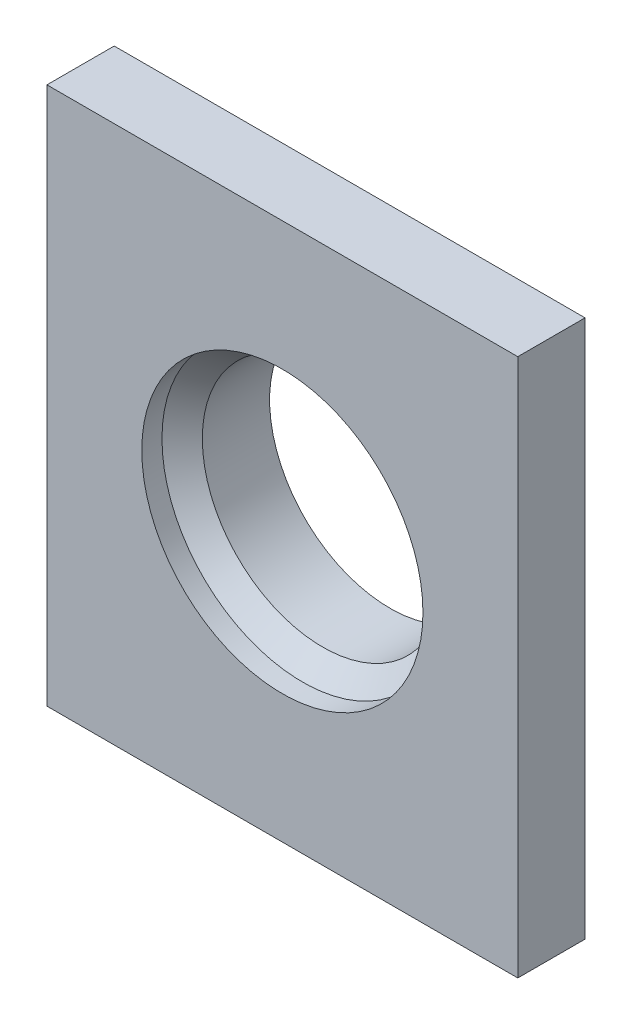
ISO-10303-21;
HEADER;
FILE_DESCRIPTION(('STEP AP214'),'2;1');
FILE_NAME('part.step','',(''),(''),'','','');
FILE_SCHEMA(('AUTOMOTIVE_DESIGN { 1 0 10303 214 1 1 1 1 }'));
ENDSEC;
DATA;
#1=APPLICATION_CONTEXT('core data for automotive mechanical design processes');
#2=APPLICATION_PROTOCOL_DEFINITION('international standard','automotive_design',2000,#1);
#3=PRODUCT_CONTEXT('',#1,'mechanical');
#4=PRODUCT('Part','Part','',(#3));
#5=PRODUCT_RELATED_PRODUCT_CATEGORY('part','',(#4));
#6=PRODUCT_DEFINITION_FORMATION('','',#4);
#7=PRODUCT_DEFINITION_CONTEXT('part definition',#1,'design');
#8=PRODUCT_DEFINITION('design','',#6,#7);
#9=PRODUCT_DEFINITION_SHAPE('','',#8);
#10=(LENGTH_UNIT() NAMED_UNIT(*) SI_UNIT(.MILLI.,.METRE.));
#11=(NAMED_UNIT(*) PLANE_ANGLE_UNIT() SI_UNIT($,.RADIAN.));
#12=(NAMED_UNIT(*) SI_UNIT($,.STERADIAN.) SOLID_ANGLE_UNIT());
#13=UNCERTAINTY_MEASURE_WITH_UNIT(LENGTH_MEASURE(1.E-05),#10,'distance_accuracy_value','');
#14=(GEOMETRIC_REPRESENTATION_CONTEXT(3) GLOBAL_UNCERTAINTY_ASSIGNED_CONTEXT((#13)) GLOBAL_UNIT_ASSIGNED_CONTEXT((#10,
#11,#12)) REPRESENTATION_CONTEXT('',''));
#15=CARTESIAN_POINT('',(0.,0.,0.));
#16=DIRECTION('',(0.,0.,1.));
#17=DIRECTION('',(1.,0.,0.));
#18=AXIS2_PLACEMENT_3D('',#15,#16,#17);
#19=CARTESIAN_POINT('',(17.5,20.,2.5));
#20=DIRECTION('',(-1.,0.,0.));
#21=DIRECTION('',(0.,0.,1.));
#22=AXIS2_PLACEMENT_3D('',#19,#20,#21);
#23=PLANE('',#22);
#24=DIRECTION('',(0.,1.,0.));
#25=VECTOR('',#24,1.);
#26=CARTESIAN_POINT('',(17.5,20.,-2.5));
#27=LINE('',#26,#25);
#28=CARTESIAN_POINT('',(17.5,-20.,-2.5));
#29=VERTEX_POINT('',#28);
#30=CARTESIAN_POINT('',(17.5,20.,-2.5));
#31=VERTEX_POINT('',#30);
#32=EDGE_CURVE('E112',#29,#31,#27,.T.);
#33=ORIENTED_EDGE('',*,*,#32,.T.);
#34=DIRECTION('',(0.,0.,-1.));
#35=VECTOR('',#34,1.);
#36=CARTESIAN_POINT('',(17.5,20.,2.5));
#37=LINE('',#36,#35);
#38=CARTESIAN_POINT('',(17.5,20.,2.5));
#39=VERTEX_POINT('',#38);
#40=EDGE_CURVE('E103',#39,#31,#37,.T.);
#41=ORIENTED_EDGE('',*,*,#40,.F.);
#42=DIRECTION('',(0.,1.,0.));
#43=VECTOR('',#42,1.);
#44=CARTESIAN_POINT('',(17.5,20.,2.5));
#45=LINE('',#44,#43);
#46=CARTESIAN_POINT('',(17.5,-20.,2.5));
#47=VERTEX_POINT('',#46);
#48=EDGE_CURVE('E97',#47,#39,#45,.T.);
#49=ORIENTED_EDGE('',*,*,#48,.F.);
#50=DIRECTION('',(0.,0.,-1.));
#51=VECTOR('',#50,1.);
#52=CARTESIAN_POINT('',(17.5,-20.,2.5));
#53=LINE('',#52,#51);
#54=EDGE_CURVE('E108',#47,#29,#53,.T.);
#55=ORIENTED_EDGE('',*,*,#54,.T.);
#56=EDGE_LOOP('',(#33,#41,#49,#55));
#57=FACE_BOUND('',#56,.T.);
#58=ADVANCED_FACE('F43',(#57),#23,.F.);
#59=CARTESIAN_POINT('',(-17.5,20.,2.5));
#60=DIRECTION('',(0.,-1.,0.));
#61=DIRECTION('',(0.,0.,-1.));
#62=AXIS2_PLACEMENT_3D('',#59,#60,#61);
#63=PLANE('',#62);
#64=DIRECTION('',(-1.,0.,0.));
#65=VECTOR('',#64,1.);
#66=CARTESIAN_POINT('',(-17.5,20.,-2.5));
#67=LINE('',#66,#65);
#68=CARTESIAN_POINT('',(-17.5,20.,-2.5));
#69=VERTEX_POINT('',#68);
#70=EDGE_CURVE('E102',#31,#69,#67,.T.);
#71=ORIENTED_EDGE('',*,*,#70,.T.);
#72=DIRECTION('',(0.,0.,-1.));
#73=VECTOR('',#72,1.);
#74=CARTESIAN_POINT('',(-17.5,20.,2.5));
#75=LINE('',#74,#73);
#76=CARTESIAN_POINT('',(-17.5,20.,2.5));
#77=VERTEX_POINT('',#76);
#78=EDGE_CURVE('E100',#77,#69,#75,.T.);
#79=ORIENTED_EDGE('',*,*,#78,.F.);
#80=DIRECTION('',(-1.,0.,0.));
#81=VECTOR('',#80,1.);
#82=CARTESIAN_POINT('',(-17.5,20.,2.5));
#83=LINE('',#82,#81);
#84=EDGE_CURVE('E92',#39,#77,#83,.T.);
#85=ORIENTED_EDGE('',*,*,#84,.F.);
#86=ORIENTED_EDGE('',*,*,#40,.T.);
#87=EDGE_LOOP('',(#71,#79,#85,#86));
#88=FACE_BOUND('',#87,.T.);
#89=ADVANCED_FACE('F101',(#88),#63,.F.);
#90=CARTESIAN_POINT('',(-17.5,20.,2.5));
#91=DIRECTION('',(1.,0.,0.));
#92=DIRECTION('',(0.,1.,0.));
#93=AXIS2_PLACEMENT_3D('',#90,#91,#92);
#94=PLANE('',#93);
#95=DIRECTION('',(0.,-1.,0.));
#96=VECTOR('',#95,1.);
#97=CARTESIAN_POINT('',(-17.5,20.,-2.5));
#98=LINE('',#97,#96);
#99=CARTESIAN_POINT('',(-17.5,-20.,-2.5));
#100=VERTEX_POINT('',#99);
#101=EDGE_CURVE('E78',#69,#100,#98,.T.);
#102=ORIENTED_EDGE('',*,*,#101,.T.);
#103=DIRECTION('',(0.,0.,-1.));
#104=VECTOR('',#103,1.);
#105=CARTESIAN_POINT('',(-17.5,-20.,2.5));
#106=LINE('',#105,#104);
#107=CARTESIAN_POINT('',(-17.5,-20.,2.5));
#108=VERTEX_POINT('',#107);
#109=EDGE_CURVE('E104',#108,#100,#106,.T.);
#110=ORIENTED_EDGE('',*,*,#109,.F.);
#111=DIRECTION('',(0.,-1.,0.));
#112=VECTOR('',#111,1.);
#113=CARTESIAN_POINT('',(-17.5,20.,2.5));
#114=LINE('',#113,#112);
#115=EDGE_CURVE('E95',#77,#108,#114,.T.);
#116=ORIENTED_EDGE('',*,*,#115,.F.);
#117=ORIENTED_EDGE('',*,*,#78,.T.);
#118=EDGE_LOOP('',(#102,#110,#116,#117));
#119=FACE_BOUND('',#118,.T.);
#120=ADVANCED_FACE('F106',(#119),#94,.F.);
#121=CARTESIAN_POINT('',(-17.5,-20.,2.5));
#122=DIRECTION('',(0.,1.,0.));
#123=DIRECTION('',(0.,0.,1.));
#124=AXIS2_PLACEMENT_3D('',#121,#122,#123);
#125=PLANE('',#124);
#126=DIRECTION('',(1.,0.,0.));
#127=VECTOR('',#126,1.);
#128=CARTESIAN_POINT('',(-17.5,-20.,-2.5));
#129=LINE('',#128,#127);
#130=EDGE_CURVE('E84',#100,#29,#129,.T.);
#131=ORIENTED_EDGE('',*,*,#130,.T.);
#132=ORIENTED_EDGE('',*,*,#54,.F.);
#133=DIRECTION('',(1.,0.,0.));
#134=VECTOR('',#133,1.);
#135=CARTESIAN_POINT('',(-17.5,-20.,2.5));
#136=LINE('',#135,#134);
#137=EDGE_CURVE('E61',#108,#47,#136,.T.);
#138=ORIENTED_EDGE('',*,*,#137,.F.);
#139=ORIENTED_EDGE('',*,*,#109,.T.);
#140=EDGE_LOOP('',(#131,#132,#138,#139));
#141=FACE_BOUND('',#140,.T.);
#142=ADVANCED_FACE('F159',(#141),#125,.F.);
#143=CARTESIAN_POINT('',(0.,0.,2.5));
#144=DIRECTION('',(0.,0.,1.));
#145=DIRECTION('',(1.,0.,0.));
#146=AXIS2_PLACEMENT_3D('',#143,#144,#145);
#147=PLANE('',#146);
#148=CARTESIAN_POINT('',(0.,0.,2.5));
#149=DIRECTION('',(0.,0.,1.));
#150=DIRECTION('',(1.,0.,0.));
#151=AXIS2_PLACEMENT_3D('',#148,#149,#150);
#152=CIRCLE('',#151,10.45);
#153=CARTESIAN_POINT('',(10.45,0.,2.5));
#154=VERTEX_POINT('',#153);
#155=EDGE_CURVE('E127',#154,#154,#152,.T.);
#156=ORIENTED_EDGE('',*,*,#155,.F.);
#157=EDGE_LOOP('',(#156));
#158=FACE_BOUND('',#157,.T.);
#159=ORIENTED_EDGE('',*,*,#48,.T.);
#160=ORIENTED_EDGE('',*,*,#84,.T.);
#161=ORIENTED_EDGE('',*,*,#115,.T.);
#162=ORIENTED_EDGE('',*,*,#137,.T.);
#163=EDGE_LOOP('',(#159,#160,#161,#162));
#164=FACE_BOUND('',#163,.T.);
#165=ADVANCED_FACE('F93',(#158,#164),#147,.T.);
#166=CARTESIAN_POINT('',(0.,0.,-2.5));
#167=DIRECTION('',(0.,0.,1.));
#168=DIRECTION('',(1.,0.,0.));
#169=AXIS2_PLACEMENT_3D('',#166,#167,#168);
#170=PLANE('',#169);
#171=CARTESIAN_POINT('',(0.,0.,-2.5));
#172=DIRECTION('',(0.,0.,1.));
#173=DIRECTION('',(1.,0.,0.));
#174=AXIS2_PLACEMENT_3D('',#171,#172,#173);
#175=CIRCLE('',#174,12.45);
#176=CARTESIAN_POINT('',(12.45,0.,-2.5));
#177=VERTEX_POINT('',#176);
#178=EDGE_CURVE('E12',#177,#177,#175,.T.);
#179=ORIENTED_EDGE('',*,*,#178,.T.);
#180=EDGE_LOOP('',(#179));
#181=FACE_BOUND('',#180,.T.);
#182=ORIENTED_EDGE('',*,*,#32,.F.);
#183=ORIENTED_EDGE('',*,*,#130,.F.);
#184=ORIENTED_EDGE('',*,*,#101,.F.);
#185=ORIENTED_EDGE('',*,*,#70,.F.);
#186=EDGE_LOOP('',(#182,#183,#184,#185));
#187=FACE_BOUND('',#186,.T.);
#188=ADVANCED_FACE('F162',(#181,#187),#170,.F.);
#189=CARTESIAN_POINT('',(0.,0.,-5.5));
#190=DIRECTION('',(0.,0.,1.));
#191=DIRECTION('',(1.,0.,0.));
#192=AXIS2_PLACEMENT_3D('',#189,#190,#191);
#193=CYLINDRICAL_SURFACE('',#192,10.95);
#194=CARTESIAN_POINT('',(0.,0.,-3.99999999999999));
#195=DIRECTION('',(0.,0.,1.));
#196=DIRECTION('',(1.,0.,0.));
#197=AXIS2_PLACEMENT_3D('',#194,#195,#196);
#198=CIRCLE('',#197,10.95);
#199=CARTESIAN_POINT('',(10.95,0.,-3.99999999999999));
#200=VERTEX_POINT('',#199);
#201=EDGE_CURVE('E53',#200,#200,#198,.F.);
#202=ORIENTED_EDGE('',*,*,#201,.T.);
#203=EDGE_LOOP('',(#202));
#204=FACE_BOUND('',#203,.T.);
#205=CARTESIAN_POINT('',(0.,0.,-5.5));
#206=DIRECTION('',(0.,0.,-1.));
#207=DIRECTION('',(-1.,0.,0.));
#208=AXIS2_PLACEMENT_3D('',#205,#206,#207);
#209=CIRCLE('',#208,10.95);
#210=CARTESIAN_POINT('',(-10.95,0.,-5.5));
#211=VERTEX_POINT('',#210);
#212=EDGE_CURVE('E115',#211,#211,#209,.T.);
#213=ORIENTED_EDGE('',*,*,#212,.F.);
#214=EDGE_LOOP('',(#213));
#215=FACE_BOUND('',#214,.T.);
#216=ADVANCED_FACE('F132',(#204,#215),#193,.T.);
#217=CARTESIAN_POINT('',(0.,0.,-5.5));
#218=DIRECTION('',(0.,0.,-1.));
#219=DIRECTION('',(-1.,0.,0.));
#220=AXIS2_PLACEMENT_3D('',#217,#218,#219);
#221=PLANE('',#220);
#222=CARTESIAN_POINT('',(0.,0.,-5.5));
#223=DIRECTION('',(0.,0.,1.));
#224=DIRECTION('',(1.,0.,0.));
#225=AXIS2_PLACEMENT_3D('',#222,#223,#224);
#226=CIRCLE('',#225,8.95);
#227=CARTESIAN_POINT('',(8.95,0.,-5.5));
#228=VERTEX_POINT('',#227);
#229=EDGE_CURVE('E126',#228,#228,#226,.T.);
#230=ORIENTED_EDGE('',*,*,#229,.T.);
#231=EDGE_LOOP('',(#230));
#232=FACE_BOUND('',#231,.T.);
#233=ORIENTED_EDGE('',*,*,#212,.T.);
#234=EDGE_LOOP('',(#233));
#235=FACE_BOUND('',#234,.T.);
#236=ADVANCED_FACE('F171',(#232,#235),#221,.T.);
#237=CARTESIAN_POINT('',(0.,0.,-5.5));
#238=DIRECTION('',(0.,0.,1.));
#239=DIRECTION('',(1.,0.,0.));
#240=AXIS2_PLACEMENT_3D('',#237,#238,#239);
#241=CYLINDRICAL_SURFACE('',#240,8.95);
#242=CARTESIAN_POINT('',(0.,0.,-0.5));
#243=DIRECTION('',(0.,0.,-1.));
#244=DIRECTION('',(-1.,0.,0.));
#245=AXIS2_PLACEMENT_3D('',#242,#243,#244);
#246=CIRCLE('',#245,8.95);
#247=CARTESIAN_POINT('',(-8.95,0.,-0.5));
#248=VERTEX_POINT('',#247);
#249=EDGE_CURVE('E123',#248,#248,#246,.F.);
#250=ORIENTED_EDGE('',*,*,#249,.T.);
#251=EDGE_LOOP('',(#250));
#252=FACE_BOUND('',#251,.T.);
#253=ORIENTED_EDGE('',*,*,#229,.F.);
#254=EDGE_LOOP('',(#253));
#255=FACE_BOUND('',#254,.T.);
#256=ADVANCED_FACE('F174',(#252,#255),#241,.F.);
#257=CARTESIAN_POINT('',(0.,0.,-35.0570634535977));
#258=DIRECTION('',(0.,0.,1.));
#259=DIRECTION('',(1.,0.,0.));
#260=AXIS2_PLACEMENT_3D('',#257,#258,#259);
#261=CYLINDRICAL_SURFACE('',#260,10.45);
#262=CARTESIAN_POINT('',(0.,0.,1.));
#263=DIRECTION('',(0.,0.,-1.));
#264=DIRECTION('',(-1.,0.,0.));
#265=AXIS2_PLACEMENT_3D('',#262,#263,#264);
#266=CIRCLE('',#265,10.45);
#267=CARTESIAN_POINT('',(-10.45,0.,1.));
#268=VERTEX_POINT('',#267);
#269=EDGE_CURVE('E122',#268,#268,#266,.T.);
#270=ORIENTED_EDGE('',*,*,#269,.T.);
#271=EDGE_LOOP('',(#270));
#272=FACE_BOUND('',#271,.T.);
#273=ORIENTED_EDGE('',*,*,#155,.T.);
#274=EDGE_LOOP('',(#273));
#275=FACE_BOUND('',#274,.T.);
#276=ADVANCED_FACE('F141',(#272,#275),#261,.F.);
#277=CARTESIAN_POINT('',(0.,0.,-0.5));
#278=DIRECTION('',(0.,0.,1.));
#279=DIRECTION('',(1.,0.,0.));
#280=AXIS2_PLACEMENT_3D('',#277,#278,#279);
#281=CONICAL_SURFACE('',#280,8.94999999999998,0.785398163397455);
#282=ORIENTED_EDGE('',*,*,#269,.F.);
#283=EDGE_LOOP('',(#282));
#284=FACE_BOUND('',#283,.T.);
#285=ORIENTED_EDGE('',*,*,#249,.F.);
#286=EDGE_LOOP('',(#285));
#287=FACE_BOUND('',#286,.T.);
#288=ADVANCED_FACE('F136',(#284,#287),#281,.F.);
#289=CARTESIAN_POINT('',(0.,0.,-3.99999999999999));
#290=DIRECTION('',(0.,0.,1.));
#291=DIRECTION('',(1.,0.,0.));
#292=AXIS2_PLACEMENT_3D('',#289,#290,#291);
#293=CONICAL_SURFACE('',#292,10.95,0.785398163397444);
#294=ORIENTED_EDGE('',*,*,#178,.F.);
#295=EDGE_LOOP('',(#294));
#296=FACE_BOUND('',#295,.T.);
#297=ORIENTED_EDGE('',*,*,#201,.F.);
#298=EDGE_LOOP('',(#297));
#299=FACE_BOUND('',#298,.T.);
#300=ADVANCED_FACE('F46',(#296,#299),#293,.T.);
#301=CLOSED_SHELL('',(#58,#89,#120,#142,#165,#188,#216,#236,#256,#276,#288,#300));
#302=MANIFOLD_SOLID_BREP('B2',#301);
#303=ADVANCED_BREP_SHAPE_REPRESENTATION('',(#18,#302),#14);
#304=SHAPE_DEFINITION_REPRESENTATION(#9,#303);
ENDSEC;
END-ISO-10303-21;
